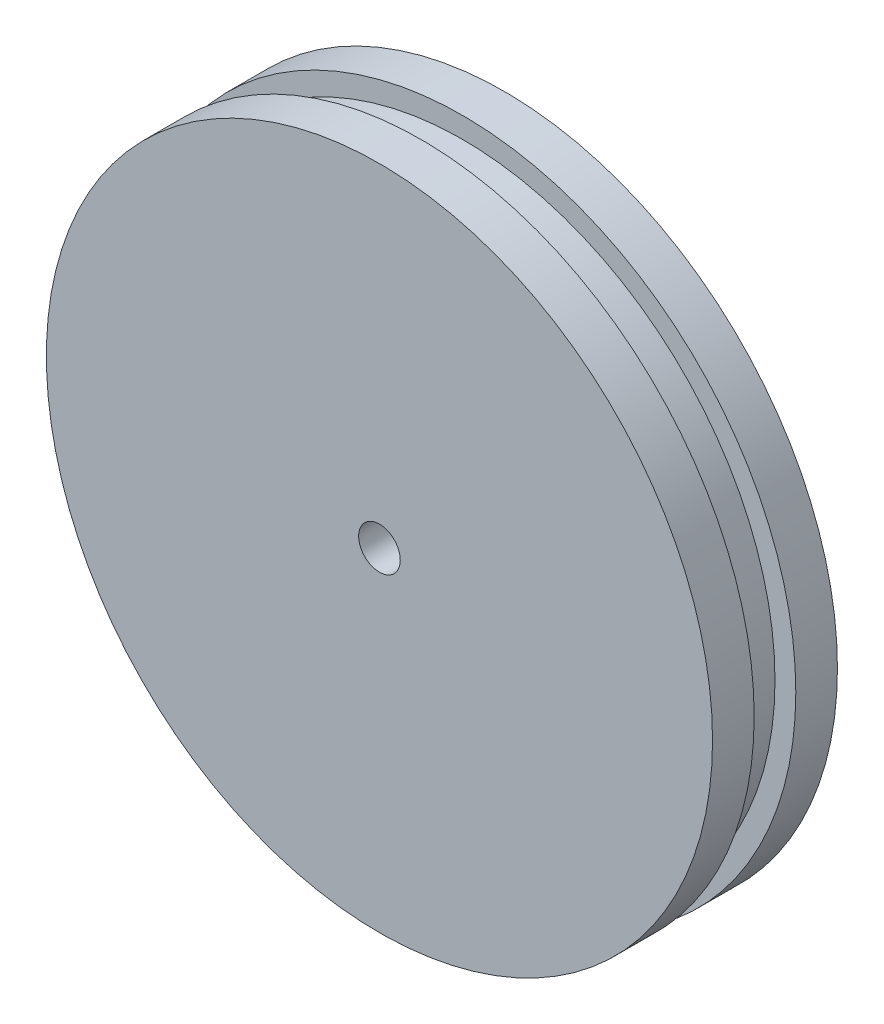
ISO-10303-21;
HEADER;
FILE_DESCRIPTION(('STEP AP214'),'2;1');
FILE_NAME('part.step','',(''),(''),'','','');
FILE_SCHEMA(('AUTOMOTIVE_DESIGN { 1 0 10303 214 1 1 1 1 }'));
ENDSEC;
DATA;
#1=APPLICATION_CONTEXT('core data for automotive mechanical design processes');
#2=APPLICATION_PROTOCOL_DEFINITION('international standard','automotive_design',2000,#1);
#3=PRODUCT_CONTEXT('',#1,'mechanical');
#4=PRODUCT('Part','Part','',(#3));
#5=PRODUCT_RELATED_PRODUCT_CATEGORY('part','',(#4));
#6=PRODUCT_DEFINITION_FORMATION('','',#4);
#7=PRODUCT_DEFINITION_CONTEXT('part definition',#1,'design');
#8=PRODUCT_DEFINITION('design','',#6,#7);
#9=PRODUCT_DEFINITION_SHAPE('','',#8);
#10=(LENGTH_UNIT() NAMED_UNIT(*) SI_UNIT(.MILLI.,.METRE.));
#11=(NAMED_UNIT(*) PLANE_ANGLE_UNIT() SI_UNIT($,.RADIAN.));
#12=(NAMED_UNIT(*) SI_UNIT($,.STERADIAN.) SOLID_ANGLE_UNIT());
#13=UNCERTAINTY_MEASURE_WITH_UNIT(LENGTH_MEASURE(1.E-05),#10,'distance_accuracy_value','');
#14=(GEOMETRIC_REPRESENTATION_CONTEXT(3) GLOBAL_UNCERTAINTY_ASSIGNED_CONTEXT((#13)) GLOBAL_UNIT_ASSIGNED_CONTEXT((#10,
#11,#12)) REPRESENTATION_CONTEXT('',''));
#15=CARTESIAN_POINT('',(0.,0.,0.));
#16=DIRECTION('',(0.,0.,1.));
#17=DIRECTION('',(1.,0.,0.));
#18=AXIS2_PLACEMENT_3D('',#15,#16,#17);
#19=CARTESIAN_POINT('',(0.,0.,7.));
#20=DIRECTION('',(0.,0.,-1.));
#21=DIRECTION('',(-1.,0.,0.));
#22=AXIS2_PLACEMENT_3D('',#19,#20,#21);
#23=CYLINDRICAL_SURFACE('',#22,56.);
#24=CARTESIAN_POINT('',(0.,0.,7.));
#25=DIRECTION('',(0.,0.,1.));
#26=DIRECTION('',(1.,0.,0.));
#27=AXIS2_PLACEMENT_3D('',#24,#25,#26);
#28=CIRCLE('',#27,56.);
#29=CARTESIAN_POINT('',(56.,0.,7.));
#30=VERTEX_POINT('',#29);
#31=EDGE_CURVE('E45',#30,#30,#28,.T.);
#32=ORIENTED_EDGE('',*,*,#31,.F.);
#33=EDGE_LOOP('',(#32));
#34=FACE_BOUND('',#33,.T.);
#35=CARTESIAN_POINT('',(0.,0.,0.));
#36=DIRECTION('',(0.,0.,1.));
#37=DIRECTION('',(1.,0.,0.));
#38=AXIS2_PLACEMENT_3D('',#35,#36,#37);
#39=CIRCLE('',#38,56.);
#40=CARTESIAN_POINT('',(56.,0.,0.));
#41=VERTEX_POINT('',#40);
#42=EDGE_CURVE('E40',#41,#41,#39,.T.);
#43=ORIENTED_EDGE('',*,*,#42,.T.);
#44=EDGE_LOOP('',(#43));
#45=FACE_BOUND('',#44,.T.);
#46=ADVANCED_FACE('F37',(#34,#45),#23,.T.);
#47=CARTESIAN_POINT('',(0.,0.,7.));
#48=DIRECTION('',(0.,0.,1.));
#49=DIRECTION('',(1.,0.,0.));
#50=AXIS2_PLACEMENT_3D('',#47,#48,#49);
#51=PLANE('',#50);
#52=CARTESIAN_POINT('',(0.,0.,7.));
#53=DIRECTION('',(0.,0.,1.));
#54=DIRECTION('',(1.,0.,0.));
#55=AXIS2_PLACEMENT_3D('',#52,#53,#54);
#56=CIRCLE('',#55,52.5);
#57=CARTESIAN_POINT('',(52.5,0.,7.));
#58=VERTEX_POINT('',#57);
#59=EDGE_CURVE('E10',#58,#58,#56,.T.);
#60=ORIENTED_EDGE('',*,*,#59,.F.);
#61=EDGE_LOOP('',(#60));
#62=FACE_BOUND('',#61,.T.);
#63=ORIENTED_EDGE('',*,*,#31,.T.);
#64=EDGE_LOOP('',(#63));
#65=FACE_BOUND('',#64,.T.);
#66=ADVANCED_FACE('F98',(#62,#65),#51,.T.);
#67=CARTESIAN_POINT('',(0.,0.,0.));
#68=DIRECTION('',(0.,0.,1.));
#69=DIRECTION('',(1.,0.,0.));
#70=AXIS2_PLACEMENT_3D('',#67,#68,#69);
#71=PLANE('',#70);
#72=CARTESIAN_POINT('',(0.,0.,0.));
#73=DIRECTION('',(0.,0.,1.));
#74=DIRECTION('',(1.,0.,0.));
#75=AXIS2_PLACEMENT_3D('',#72,#73,#74);
#76=CIRCLE('',#75,3.5);
#77=CARTESIAN_POINT('',(3.5,0.,0.));
#78=VERTEX_POINT('',#77);
#79=EDGE_CURVE('E61',#78,#78,#76,.T.);
#80=ORIENTED_EDGE('',*,*,#79,.T.);
#81=EDGE_LOOP('',(#80));
#82=FACE_BOUND('',#81,.T.);
#83=ORIENTED_EDGE('',*,*,#42,.F.);
#84=EDGE_LOOP('',(#83));
#85=FACE_BOUND('',#84,.T.);
#86=ADVANCED_FACE('F103',(#82,#85),#71,.F.);
#87=CARTESIAN_POINT('',(0.,0.,14.));
#88=DIRECTION('',(0.,0.,-1.));
#89=DIRECTION('',(-1.,0.,0.));
#90=AXIS2_PLACEMENT_3D('',#87,#88,#89);
#91=CYLINDRICAL_SURFACE('',#90,52.5);
#92=CARTESIAN_POINT('',(0.,0.,14.));
#93=DIRECTION('',(0.,0.,1.));
#94=DIRECTION('',(1.,0.,0.));
#95=AXIS2_PLACEMENT_3D('',#92,#93,#94);
#96=CIRCLE('',#95,52.5);
#97=CARTESIAN_POINT('',(52.5,0.,14.));
#98=VERTEX_POINT('',#97);
#99=EDGE_CURVE('E52',#98,#98,#96,.T.);
#100=ORIENTED_EDGE('',*,*,#99,.F.);
#101=EDGE_LOOP('',(#100));
#102=FACE_BOUND('',#101,.T.);
#103=ORIENTED_EDGE('',*,*,#59,.T.);
#104=EDGE_LOOP('',(#103));
#105=FACE_BOUND('',#104,.T.);
#106=ADVANCED_FACE('F86',(#102,#105),#91,.T.);
#107=CARTESIAN_POINT('',(0.,0.,21.));
#108=DIRECTION('',(0.,0.,-1.));
#109=DIRECTION('',(-1.,0.,0.));
#110=AXIS2_PLACEMENT_3D('',#107,#108,#109);
#111=CYLINDRICAL_SURFACE('',#110,56.);
#112=CARTESIAN_POINT('',(0.,0.,21.));
#113=DIRECTION('',(0.,0.,1.));
#114=DIRECTION('',(1.,0.,0.));
#115=AXIS2_PLACEMENT_3D('',#112,#113,#114);
#116=CIRCLE('',#115,56.);
#117=CARTESIAN_POINT('',(56.,0.,21.));
#118=VERTEX_POINT('',#117);
#119=EDGE_CURVE('E56',#118,#118,#116,.T.);
#120=ORIENTED_EDGE('',*,*,#119,.F.);
#121=EDGE_LOOP('',(#120));
#122=FACE_BOUND('',#121,.T.);
#123=CARTESIAN_POINT('',(0.,0.,14.));
#124=DIRECTION('',(0.,0.,1.));
#125=DIRECTION('',(1.,0.,0.));
#126=AXIS2_PLACEMENT_3D('',#123,#124,#125);
#127=CIRCLE('',#126,56.);
#128=CARTESIAN_POINT('',(56.,0.,14.));
#129=VERTEX_POINT('',#128);
#130=EDGE_CURVE('E57',#129,#129,#127,.T.);
#131=ORIENTED_EDGE('',*,*,#130,.T.);
#132=EDGE_LOOP('',(#131));
#133=FACE_BOUND('',#132,.T.);
#134=ADVANCED_FACE('F80',(#122,#133),#111,.T.);
#135=CARTESIAN_POINT('',(0.,0.,21.));
#136=DIRECTION('',(0.,0.,1.));
#137=DIRECTION('',(1.,0.,0.));
#138=AXIS2_PLACEMENT_3D('',#135,#136,#137);
#139=PLANE('',#138);
#140=CARTESIAN_POINT('',(0.,0.,21.));
#141=DIRECTION('',(0.,0.,1.));
#142=DIRECTION('',(1.,0.,0.));
#143=AXIS2_PLACEMENT_3D('',#140,#141,#142);
#144=CIRCLE('',#143,3.5);
#145=CARTESIAN_POINT('',(3.5,0.,21.));
#146=VERTEX_POINT('',#145);
#147=EDGE_CURVE('E68',#146,#146,#144,.T.);
#148=ORIENTED_EDGE('',*,*,#147,.F.);
#149=EDGE_LOOP('',(#148));
#150=FACE_BOUND('',#149,.T.);
#151=ORIENTED_EDGE('',*,*,#119,.T.);
#152=EDGE_LOOP('',(#151));
#153=FACE_BOUND('',#152,.T.);
#154=ADVANCED_FACE('F76',(#150,#153),#139,.T.);
#155=CARTESIAN_POINT('',(0.,0.,14.));
#156=DIRECTION('',(0.,0.,1.));
#157=DIRECTION('',(1.,0.,0.));
#158=AXIS2_PLACEMENT_3D('',#155,#156,#157);
#159=PLANE('',#158);
#160=ORIENTED_EDGE('',*,*,#99,.T.);
#161=EDGE_LOOP('',(#160));
#162=FACE_BOUND('',#161,.T.);
#163=ORIENTED_EDGE('',*,*,#130,.F.);
#164=EDGE_LOOP('',(#163));
#165=FACE_BOUND('',#164,.T.);
#166=ADVANCED_FACE('F79',(#162,#165),#159,.F.);
#167=CARTESIAN_POINT('',(0.,0.,-56.));
#168=DIRECTION('',(0.,0.,1.));
#169=DIRECTION('',(1.,0.,0.));
#170=AXIS2_PLACEMENT_3D('',#167,#168,#169);
#171=CYLINDRICAL_SURFACE('',#170,3.5);
#172=ORIENTED_EDGE('',*,*,#147,.T.);
#173=EDGE_LOOP('',(#172));
#174=FACE_BOUND('',#173,.T.);
#175=ORIENTED_EDGE('',*,*,#79,.F.);
#176=EDGE_LOOP('',(#175));
#177=FACE_BOUND('',#176,.T.);
#178=ADVANCED_FACE('F73',(#174,#177),#171,.F.);
#179=CLOSED_SHELL('',(#46,#66,#86,#106,#134,#154,#166,#178));
#180=MANIFOLD_SOLID_BREP('B2',#179);
#181=ADVANCED_BREP_SHAPE_REPRESENTATION('',(#18,#180),#14);
#182=SHAPE_DEFINITION_REPRESENTATION(#9,#181);
ENDSEC;
END-ISO-10303-21;
